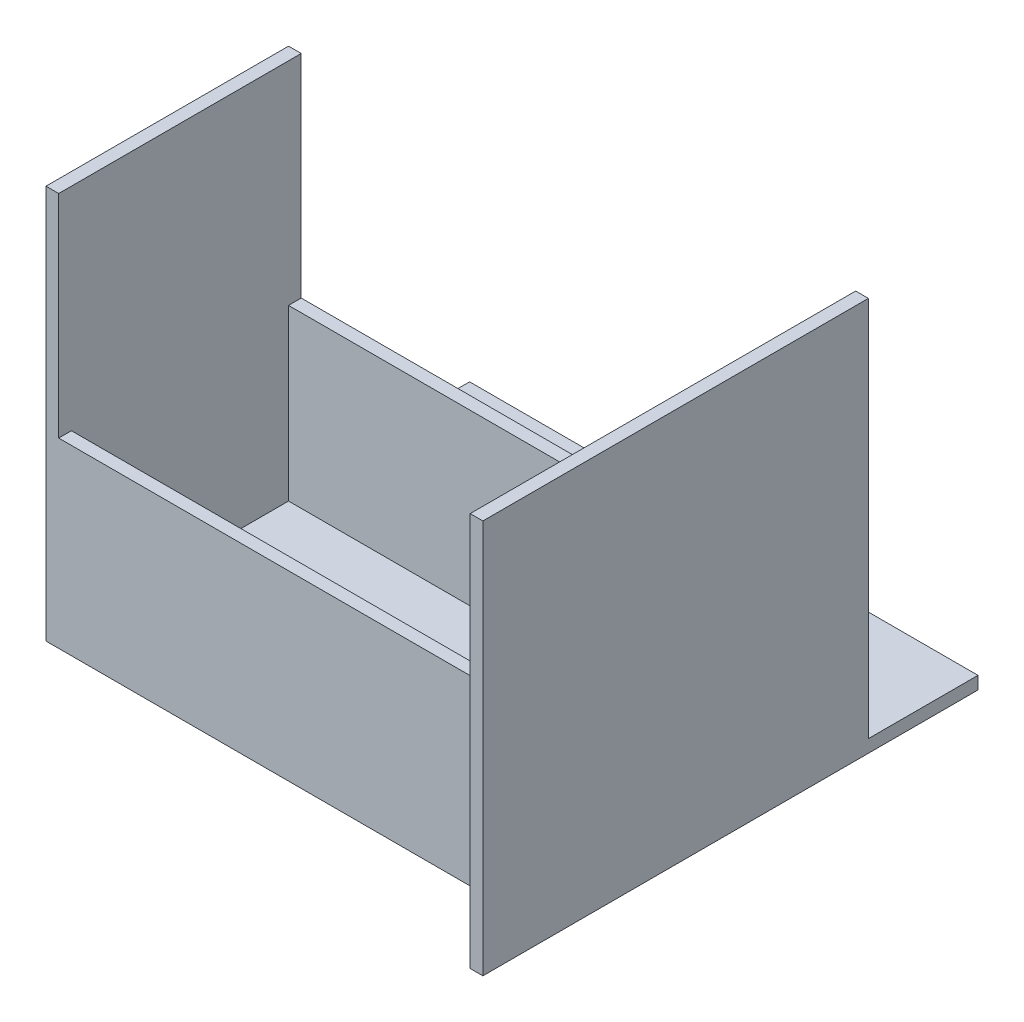
ISO-10303-21;
HEADER;
FILE_DESCRIPTION(('STEP AP214'),'2;1');
FILE_NAME('part.step','',(''),(''),'','','');
FILE_SCHEMA(('AUTOMOTIVE_DESIGN { 1 0 10303 214 1 1 1 1 }'));
ENDSEC;
DATA;
#1=APPLICATION_CONTEXT('core data for automotive mechanical design processes');
#2=APPLICATION_PROTOCOL_DEFINITION('international standard','automotive_design',2000,#1);
#3=PRODUCT_CONTEXT('',#1,'mechanical');
#4=PRODUCT('Part','Part','',(#3));
#5=PRODUCT_RELATED_PRODUCT_CATEGORY('part','',(#4));
#6=PRODUCT_DEFINITION_FORMATION('','',#4);
#7=PRODUCT_DEFINITION_CONTEXT('part definition',#1,'design');
#8=PRODUCT_DEFINITION('design','',#6,#7);
#9=PRODUCT_DEFINITION_SHAPE('','',#8);
#10=(LENGTH_UNIT() NAMED_UNIT(*) SI_UNIT(.MILLI.,.METRE.));
#11=(NAMED_UNIT(*) PLANE_ANGLE_UNIT() SI_UNIT($,.RADIAN.));
#12=(NAMED_UNIT(*) SI_UNIT($,.STERADIAN.) SOLID_ANGLE_UNIT());
#13=UNCERTAINTY_MEASURE_WITH_UNIT(LENGTH_MEASURE(1.E-05),#10,'distance_accuracy_value','');
#14=(GEOMETRIC_REPRESENTATION_CONTEXT(3) GLOBAL_UNCERTAINTY_ASSIGNED_CONTEXT((#13)) GLOBAL_UNIT_ASSIGNED_CONTEXT((#10,
#11,#12)) REPRESENTATION_CONTEXT('',''));
#15=CARTESIAN_POINT('',(0.,0.,0.));
#16=DIRECTION('',(0.,0.,1.));
#17=DIRECTION('',(1.,0.,0.));
#18=AXIS2_PLACEMENT_3D('',#15,#16,#17);
#19=CARTESIAN_POINT('',(0.,43.,0.));
#20=DIRECTION('',(0.,1.,0.));
#21=DIRECTION('',(0.,0.,1.));
#22=AXIS2_PLACEMENT_3D('',#19,#20,#21);
#23=PLANE('',#22);
#24=DIRECTION('',(0.,0.,1.));
#25=VECTOR('',#24,1.);
#26=CARTESIAN_POINT('',(117.,43.,0.));
#27=LINE('',#26,#25);
#28=CARTESIAN_POINT('',(117.,43.,-57.25));
#29=VERTEX_POINT('',#28);
#30=CARTESIAN_POINT('',(117.,43.,-54.25));
#31=VERTEX_POINT('',#30);
#32=EDGE_CURVE('E190',#29,#31,#27,.T.);
#33=ORIENTED_EDGE('',*,*,#32,.F.);
#34=DIRECTION('',(1.,0.,0.));
#35=VECTOR('',#34,1.);
#36=CARTESIAN_POINT('',(0.,43.,-57.25));
#37=LINE('',#36,#35);
#38=CARTESIAN_POINT('',(3.,43.,-57.25));
#39=VERTEX_POINT('',#38);
#40=EDGE_CURVE('E218',#39,#29,#37,.T.);
#41=ORIENTED_EDGE('',*,*,#40,.F.);
#42=DIRECTION('',(0.,0.,-1.));
#43=VECTOR('',#42,1.);
#44=CARTESIAN_POINT('',(3.,43.,-57.25));
#45=LINE('',#44,#43);
#46=CARTESIAN_POINT('',(3.,43.,-54.25));
#47=VERTEX_POINT('',#46);
#48=EDGE_CURVE('E11',#47,#39,#45,.T.);
#49=ORIENTED_EDGE('',*,*,#48,.F.);
#50=DIRECTION('',(-1.,0.,0.));
#51=VECTOR('',#50,1.);
#52=CARTESIAN_POINT('',(0.,43.,-54.25));
#53=LINE('',#52,#51);
#54=EDGE_CURVE('E222',#31,#47,#53,.T.);
#55=ORIENTED_EDGE('',*,*,#54,.F.);
#56=EDGE_LOOP('',(#33,#41,#49,#55));
#57=FACE_BOUND('',#56,.T.);
#58=ADVANCED_FACE('F35',(#57),#23,.T.);
#59=CARTESIAN_POINT('',(0.,3.,0.));
#60=DIRECTION('',(0.,-1.,0.));
#61=DIRECTION('',(0.,0.,-1.));
#62=AXIS2_PLACEMENT_3D('',#59,#60,#61);
#63=PLANE('',#62);
#64=DIRECTION('',(1.,0.,0.));
#65=VECTOR('',#64,1.);
#66=CARTESIAN_POINT('',(0.,3.,-57.25));
#67=LINE('',#66,#65);
#68=CARTESIAN_POINT('',(0.,3.,-57.25));
#69=VERTEX_POINT('',#68);
#70=CARTESIAN_POINT('',(117.,3.,-57.25));
#71=VERTEX_POINT('',#70);
#72=EDGE_CURVE('E214',#69,#71,#67,.T.);
#73=ORIENTED_EDGE('',*,*,#72,.T.);
#74=DIRECTION('',(0.,0.,-1.));
#75=VECTOR('',#74,1.);
#76=CARTESIAN_POINT('',(117.,3.,0.));
#77=LINE('',#76,#75);
#78=CARTESIAN_POINT('',(117.,3.,-74.125));
#79=VERTEX_POINT('',#78);
#80=EDGE_CURVE('E52',#71,#79,#77,.T.);
#81=ORIENTED_EDGE('',*,*,#80,.T.);
#82=DIRECTION('',(-1.,0.,0.));
#83=VECTOR('',#82,1.);
#84=CARTESIAN_POINT('',(0.,3.,-74.125));
#85=LINE('',#84,#83);
#86=CARTESIAN_POINT('',(120.,3.,-74.125));
#87=VERTEX_POINT('',#86);
#88=EDGE_CURVE('E56',#87,#79,#85,.T.);
#89=ORIENTED_EDGE('',*,*,#88,.F.);
#90=DIRECTION('',(0.,0.,-1.));
#91=VECTOR('',#90,1.);
#92=CARTESIAN_POINT('',(120.,3.,0.));
#93=LINE('',#92,#91);
#94=CARTESIAN_POINT('',(120.,3.,-100.));
#95=VERTEX_POINT('',#94);
#96=EDGE_CURVE('E254',#87,#95,#93,.T.);
#97=ORIENTED_EDGE('',*,*,#96,.T.);
#98=DIRECTION('',(-1.,0.,0.));
#99=VECTOR('',#98,1.);
#100=CARTESIAN_POINT('',(0.,3.,-100.));
#101=LINE('',#100,#99);
#102=CARTESIAN_POINT('',(0.,3.,-100.));
#103=VERTEX_POINT('',#102);
#104=EDGE_CURVE('E257',#95,#103,#101,.T.);
#105=ORIENTED_EDGE('',*,*,#104,.T.);
#106=DIRECTION('',(0.,0.,1.));
#107=VECTOR('',#106,1.);
#108=CARTESIAN_POINT('',(0.,3.,0.));
#109=LINE('',#108,#107);
#110=EDGE_CURVE('E251',#103,#69,#109,.T.);
#111=ORIENTED_EDGE('',*,*,#110,.T.);
#112=EDGE_LOOP('',(#73,#81,#89,#97,#105,#111));
#113=FACE_BOUND('',#112,.T.);
#114=ADVANCED_FACE('F306',(#113),#63,.F.);
#115=CARTESIAN_POINT('',(0.,3.,0.));
#116=DIRECTION('',(1.,0.,0.));
#117=DIRECTION('',(0.,0.,-1.));
#118=AXIS2_PLACEMENT_3D('',#115,#116,#117);
#119=PLANE('',#118);
#120=DIRECTION('',(0.,0.,1.));
#121=VECTOR('',#120,1.);
#122=CARTESIAN_POINT('',(0.,0.,0.));
#123=LINE('',#122,#121);
#124=CARTESIAN_POINT('',(0.,0.,-100.));
#125=VERTEX_POINT('',#124);
#126=CARTESIAN_POINT('',(0.,0.,0.));
#127=VERTEX_POINT('',#126);
#128=EDGE_CURVE('E249',#125,#127,#123,.T.);
#129=ORIENTED_EDGE('',*,*,#128,.T.);
#130=DIRECTION('',(0.,-1.,0.));
#131=VECTOR('',#130,1.);
#132=CARTESIAN_POINT('',(0.,3.,0.));
#133=LINE('',#132,#131);
#134=CARTESIAN_POINT('',(0.,93.,0.));
#135=VERTEX_POINT('',#134);
#136=EDGE_CURVE('E39',#135,#127,#133,.T.);
#137=ORIENTED_EDGE('',*,*,#136,.F.);
#138=DIRECTION('',(0.,0.,1.));
#139=VECTOR('',#138,1.);
#140=CARTESIAN_POINT('',(0.,93.,-57.25));
#141=LINE('',#140,#139);
#142=CARTESIAN_POINT('',(0.,93.,-57.25));
#143=VERTEX_POINT('',#142);
#144=EDGE_CURVE('E197',#143,#135,#141,.T.);
#145=ORIENTED_EDGE('',*,*,#144,.F.);
#146=DIRECTION('',(0.,-1.,0.));
#147=VECTOR('',#146,1.);
#148=CARTESIAN_POINT('',(0.,43.,-57.25));
#149=LINE('',#148,#147);
#150=EDGE_CURVE('E228',#143,#69,#149,.T.);
#151=ORIENTED_EDGE('',*,*,#150,.T.);
#152=ORIENTED_EDGE('',*,*,#110,.F.);
#153=DIRECTION('',(0.,-1.,0.));
#154=VECTOR('',#153,1.);
#155=CARTESIAN_POINT('',(0.,3.,-100.));
#156=LINE('',#155,#154);
#157=EDGE_CURVE('E259',#103,#125,#156,.T.);
#158=ORIENTED_EDGE('',*,*,#157,.T.);
#159=EDGE_LOOP('',(#129,#137,#145,#151,#152,#158));
#160=FACE_BOUND('',#159,.T.);
#161=ADVANCED_FACE('F37',(#160),#119,.F.);
#162=CARTESIAN_POINT('',(0.,3.,0.));
#163=DIRECTION('',(0.,0.,-1.));
#164=DIRECTION('',(-1.,0.,0.));
#165=AXIS2_PLACEMENT_3D('',#162,#163,#164);
#166=PLANE('',#165);
#167=DIRECTION('',(1.,0.,0.));
#168=VECTOR('',#167,1.);
#169=CARTESIAN_POINT('',(0.,0.,0.));
#170=LINE('',#169,#168);
#171=CARTESIAN_POINT('',(117.,0.,0.));
#172=VERTEX_POINT('',#171);
#173=EDGE_CURVE('E262',#127,#172,#170,.T.);
#174=ORIENTED_EDGE('',*,*,#173,.T.);
#175=DIRECTION('',(0.,1.,0.));
#176=VECTOR('',#175,1.);
#177=CARTESIAN_POINT('',(117.,3.,0.));
#178=LINE('',#177,#176);
#179=CARTESIAN_POINT('',(117.,43.,0.));
#180=VERTEX_POINT('',#179);
#181=EDGE_CURVE('E189',#172,#180,#178,.T.);
#182=ORIENTED_EDGE('',*,*,#181,.T.);
#183=DIRECTION('',(1.,0.,0.));
#184=VECTOR('',#183,1.);
#185=CARTESIAN_POINT('',(0.,43.,0.));
#186=LINE('',#185,#184);
#187=CARTESIAN_POINT('',(3.,43.,0.));
#188=VERTEX_POINT('',#187);
#189=EDGE_CURVE('E215',#188,#180,#186,.T.);
#190=ORIENTED_EDGE('',*,*,#189,.F.);
#191=DIRECTION('',(0.,-1.,0.));
#192=VECTOR('',#191,1.);
#193=CARTESIAN_POINT('',(3.00000000000001,93.,0.));
#194=LINE('',#193,#192);
#195=CARTESIAN_POINT('',(3.00000000000001,93.,0.));
#196=VERTEX_POINT('',#195);
#197=EDGE_CURVE('E211',#196,#188,#194,.T.);
#198=ORIENTED_EDGE('',*,*,#197,.F.);
#199=DIRECTION('',(1.,0.,0.));
#200=VECTOR('',#199,1.);
#201=CARTESIAN_POINT('',(0.,93.,0.));
#202=LINE('',#201,#200);
#203=EDGE_CURVE('E200',#135,#196,#202,.T.);
#204=ORIENTED_EDGE('',*,*,#203,.F.);
#205=ORIENTED_EDGE('',*,*,#136,.T.);
#206=EDGE_LOOP('',(#174,#182,#190,#198,#204,#205));
#207=FACE_BOUND('',#206,.T.);
#208=ADVANCED_FACE('F277',(#207),#166,.F.);
#209=CARTESIAN_POINT('',(120.,3.,0.));
#210=DIRECTION('',(-1.,0.,0.));
#211=DIRECTION('',(0.,0.,1.));
#212=AXIS2_PLACEMENT_3D('',#209,#210,#211);
#213=PLANE('',#212);
#214=ORIENTED_EDGE('',*,*,#96,.F.);
#215=DIRECTION('',(0.,-1.,0.));
#216=VECTOR('',#215,1.);
#217=CARTESIAN_POINT('',(120.,184.04943712072,-74.125));
#218=LINE('',#217,#216);
#219=CARTESIAN_POINT('',(120.,93.,-74.125));
#220=VERTEX_POINT('',#219);
#221=EDGE_CURVE('E165',#220,#87,#218,.T.);
#222=ORIENTED_EDGE('',*,*,#221,.F.);
#223=DIRECTION('',(0.,0.,-1.));
#224=VECTOR('',#223,1.);
#225=CARTESIAN_POINT('',(120.,93.,0.));
#226=LINE('',#225,#224);
#227=CARTESIAN_POINT('',(120.,93.,16.875));
#228=VERTEX_POINT('',#227);
#229=EDGE_CURVE('E155',#228,#220,#226,.T.);
#230=ORIENTED_EDGE('',*,*,#229,.F.);
#231=DIRECTION('',(0.,-1.,0.));
#232=VECTOR('',#231,1.);
#233=CARTESIAN_POINT('',(120.,184.04943712072,16.875));
#234=LINE('',#233,#232);
#235=CARTESIAN_POINT('',(120.,0.,16.875));
#236=VERTEX_POINT('',#235);
#237=EDGE_CURVE('E180',#228,#236,#234,.T.);
#238=ORIENTED_EDGE('',*,*,#237,.T.);
#239=DIRECTION('',(0.,0.,-1.));
#240=VECTOR('',#239,1.);
#241=CARTESIAN_POINT('',(120.,0.,0.));
#242=LINE('',#241,#240);
#243=CARTESIAN_POINT('',(120.,0.,-100.));
#244=VERTEX_POINT('',#243);
#245=EDGE_CURVE('E264',#236,#244,#242,.T.);
#246=ORIENTED_EDGE('',*,*,#245,.T.);
#247=DIRECTION('',(0.,-1.,0.));
#248=VECTOR('',#247,1.);
#249=CARTESIAN_POINT('',(120.,3.,-100.));
#250=LINE('',#249,#248);
#251=EDGE_CURVE('E268',#95,#244,#250,.T.);
#252=ORIENTED_EDGE('',*,*,#251,.F.);
#253=EDGE_LOOP('',(#214,#222,#230,#238,#246,#252));
#254=FACE_BOUND('',#253,.T.);
#255=ADVANCED_FACE('F309',(#254),#213,.F.);
#256=CARTESIAN_POINT('',(0.,3.,-100.));
#257=DIRECTION('',(0.,0.,1.));
#258=DIRECTION('',(1.,0.,0.));
#259=AXIS2_PLACEMENT_3D('',#256,#257,#258);
#260=PLANE('',#259);
#261=DIRECTION('',(-1.,0.,0.));
#262=VECTOR('',#261,1.);
#263=CARTESIAN_POINT('',(0.,0.,-100.));
#264=LINE('',#263,#262);
#265=EDGE_CURVE('E255',#244,#125,#264,.T.);
#266=ORIENTED_EDGE('',*,*,#265,.T.);
#267=ORIENTED_EDGE('',*,*,#157,.F.);
#268=ORIENTED_EDGE('',*,*,#104,.F.);
#269=ORIENTED_EDGE('',*,*,#251,.T.);
#270=EDGE_LOOP('',(#266,#267,#268,#269));
#271=FACE_BOUND('',#270,.T.);
#272=ADVANCED_FACE('F307',(#271),#260,.F.);
#273=CARTESIAN_POINT('',(0.,0.,0.));
#274=DIRECTION('',(0.,-1.,0.));
#275=DIRECTION('',(0.,0.,-1.));
#276=AXIS2_PLACEMENT_3D('',#273,#274,#275);
#277=PLANE('',#276);
#278=ORIENTED_EDGE('',*,*,#245,.F.);
#279=DIRECTION('',(-1.,0.,0.));
#280=VECTOR('',#279,1.);
#281=CARTESIAN_POINT('',(0.,0.,16.8750000000001));
#282=LINE('',#281,#280);
#283=CARTESIAN_POINT('',(117.,0.,16.875));
#284=VERTEX_POINT('',#283);
#285=EDGE_CURVE('E159',#236,#284,#282,.T.);
#286=ORIENTED_EDGE('',*,*,#285,.T.);
#287=DIRECTION('',(0.,0.,-1.));
#288=VECTOR('',#287,1.);
#289=CARTESIAN_POINT('',(117.,0.,0.));
#290=LINE('',#289,#288);
#291=EDGE_CURVE('E172',#284,#172,#290,.T.);
#292=ORIENTED_EDGE('',*,*,#291,.T.);
#293=ORIENTED_EDGE('',*,*,#173,.F.);
#294=ORIENTED_EDGE('',*,*,#128,.F.);
#295=ORIENTED_EDGE('',*,*,#265,.F.);
#296=EDGE_LOOP('',(#278,#286,#292,#293,#294,#295));
#297=FACE_BOUND('',#296,.T.);
#298=ADVANCED_FACE('F286',(#297),#277,.T.);
#299=CARTESIAN_POINT('',(0.,43.,-54.25));
#300=DIRECTION('',(0.,0.,1.));
#301=DIRECTION('',(1.,0.,0.));
#302=AXIS2_PLACEMENT_3D('',#299,#300,#301);
#303=PLANE('',#302);
#304=DIRECTION('',(-1.,0.,0.));
#305=VECTOR('',#304,1.);
#306=CARTESIAN_POINT('',(0.,3.,-54.25));
#307=LINE('',#306,#305);
#308=CARTESIAN_POINT('',(117.,3.,-54.25));
#309=VERTEX_POINT('',#308);
#310=CARTESIAN_POINT('',(3.,3.,-54.25));
#311=VERTEX_POINT('',#310);
#312=EDGE_CURVE('E230',#309,#311,#307,.T.);
#313=ORIENTED_EDGE('',*,*,#312,.F.);
#314=DIRECTION('',(0.,-1.,0.));
#315=VECTOR('',#314,1.);
#316=CARTESIAN_POINT('',(117.,43.,-54.25));
#317=LINE('',#316,#315);
#318=EDGE_CURVE('E246',#31,#309,#317,.T.);
#319=ORIENTED_EDGE('',*,*,#318,.F.);
#320=ORIENTED_EDGE('',*,*,#54,.T.);
#321=DIRECTION('',(0.,-1.,0.));
#322=VECTOR('',#321,1.);
#323=CARTESIAN_POINT('',(3.,43.,-54.25));
#324=LINE('',#323,#322);
#325=EDGE_CURVE('E237',#47,#311,#324,.T.);
#326=ORIENTED_EDGE('',*,*,#325,.T.);
#327=EDGE_LOOP('',(#313,#319,#320,#326));
#328=FACE_BOUND('',#327,.T.);
#329=ADVANCED_FACE('F316',(#328),#303,.T.);
#330=CARTESIAN_POINT('',(117.,43.,0.));
#331=DIRECTION('',(1.,0.,0.));
#332=DIRECTION('',(0.,0.,-1.));
#333=AXIS2_PLACEMENT_3D('',#330,#331,#332);
#334=PLANE('',#333);
#335=DIRECTION('',(0.,0.,1.));
#336=VECTOR('',#335,1.);
#337=CARTESIAN_POINT('',(117.,3.,0.));
#338=LINE('',#337,#336);
#339=CARTESIAN_POINT('',(117.,3.,-3.));
#340=VERTEX_POINT('',#339);
#341=EDGE_CURVE('E232',#309,#340,#338,.T.);
#342=ORIENTED_EDGE('',*,*,#341,.T.);
#343=DIRECTION('',(0.,-1.,0.));
#344=VECTOR('',#343,1.);
#345=CARTESIAN_POINT('',(117.,43.,-3.));
#346=LINE('',#345,#344);
#347=CARTESIAN_POINT('',(117.,43.,-3.));
#348=VERTEX_POINT('',#347);
#349=EDGE_CURVE('E243',#348,#340,#346,.T.);
#350=ORIENTED_EDGE('',*,*,#349,.F.);
#351=EDGE_CURVE('E186',#348,#180,#27,.T.);
#352=ORIENTED_EDGE('',*,*,#351,.T.);
#353=ORIENTED_EDGE('',*,*,#181,.F.);
#354=ORIENTED_EDGE('',*,*,#291,.F.);
#355=DIRECTION('',(0.,-1.,0.));
#356=VECTOR('',#355,1.);
#357=CARTESIAN_POINT('',(117.,184.04943712072,16.875));
#358=LINE('',#357,#356);
#359=CARTESIAN_POINT('',(117.,93.,16.875));
#360=VERTEX_POINT('',#359);
#361=EDGE_CURVE('E171',#360,#284,#358,.T.);
#362=ORIENTED_EDGE('',*,*,#361,.F.);
#363=DIRECTION('',(0.,0.,-1.));
#364=VECTOR('',#363,1.);
#365=CARTESIAN_POINT('',(117.,93.,0.));
#366=LINE('',#365,#364);
#367=CARTESIAN_POINT('',(117.,93.,-74.125));
#368=VERTEX_POINT('',#367);
#369=EDGE_CURVE('E152',#360,#368,#366,.T.);
#370=ORIENTED_EDGE('',*,*,#369,.T.);
#371=DIRECTION('',(0.,-1.,0.));
#372=VECTOR('',#371,1.);
#373=CARTESIAN_POINT('',(117.,184.04943712072,-74.125));
#374=LINE('',#373,#372);
#375=EDGE_CURVE('E162',#368,#79,#374,.T.);
#376=ORIENTED_EDGE('',*,*,#375,.T.);
#377=ORIENTED_EDGE('',*,*,#80,.F.);
#378=DIRECTION('',(0.,1.,0.));
#379=VECTOR('',#378,1.);
#380=CARTESIAN_POINT('',(117.,43.,-57.25));
#381=LINE('',#380,#379);
#382=EDGE_CURVE('E192',#71,#29,#381,.T.);
#383=ORIENTED_EDGE('',*,*,#382,.T.);
#384=ORIENTED_EDGE('',*,*,#32,.T.);
#385=ORIENTED_EDGE('',*,*,#318,.T.);
#386=EDGE_LOOP('',(#342,#350,#352,#353,#354,#362,#370,#376,#377,#383,#384,#385));
#387=FACE_BOUND('',#386,.T.);
#388=ADVANCED_FACE('F169',(#387),#334,.F.);
#389=CARTESIAN_POINT('',(0.,43.,-3.));
#390=DIRECTION('',(0.,0.,-1.));
#391=DIRECTION('',(-1.,0.,0.));
#392=AXIS2_PLACEMENT_3D('',#389,#390,#391);
#393=PLANE('',#392);
#394=DIRECTION('',(1.,0.,0.));
#395=VECTOR('',#394,1.);
#396=CARTESIAN_POINT('',(0.,3.,-3.));
#397=LINE('',#396,#395);
#398=CARTESIAN_POINT('',(3.00000000000001,3.,-3.));
#399=VERTEX_POINT('',#398);
#400=EDGE_CURVE('E234',#399,#340,#397,.T.);
#401=ORIENTED_EDGE('',*,*,#400,.F.);
#402=DIRECTION('',(0.,-1.,0.));
#403=VECTOR('',#402,1.);
#404=CARTESIAN_POINT('',(3.00000000000001,43.,-3.));
#405=LINE('',#404,#403);
#406=CARTESIAN_POINT('',(3.00000000000001,43.,-3.));
#407=VERTEX_POINT('',#406);
#408=EDGE_CURVE('E240',#407,#399,#405,.T.);
#409=ORIENTED_EDGE('',*,*,#408,.F.);
#410=DIRECTION('',(1.,0.,0.));
#411=VECTOR('',#410,1.);
#412=CARTESIAN_POINT('',(0.,43.,-3.));
#413=LINE('',#412,#411);
#414=EDGE_CURVE('E225',#407,#348,#413,.T.);
#415=ORIENTED_EDGE('',*,*,#414,.T.);
#416=ORIENTED_EDGE('',*,*,#349,.T.);
#417=EDGE_LOOP('',(#401,#409,#415,#416));
#418=FACE_BOUND('',#417,.T.);
#419=ADVANCED_FACE('F344',(#418),#393,.T.);
#420=CARTESIAN_POINT('',(0.,43.,-57.25));
#421=DIRECTION('',(0.,0.,-1.));
#422=DIRECTION('',(-1.,0.,0.));
#423=AXIS2_PLACEMENT_3D('',#420,#421,#422);
#424=PLANE('',#423);
#425=ORIENTED_EDGE('',*,*,#382,.F.);
#426=ORIENTED_EDGE('',*,*,#72,.F.);
#427=ORIENTED_EDGE('',*,*,#150,.F.);
#428=DIRECTION('',(-1.,0.,0.));
#429=VECTOR('',#428,1.);
#430=CARTESIAN_POINT('',(0.,93.,-57.25));
#431=LINE('',#430,#429);
#432=CARTESIAN_POINT('',(3.,93.,-57.25));
#433=VERTEX_POINT('',#432);
#434=EDGE_CURVE('E204',#433,#143,#431,.T.);
#435=ORIENTED_EDGE('',*,*,#434,.F.);
#436=DIRECTION('',(0.,-1.,0.));
#437=VECTOR('',#436,1.);
#438=CARTESIAN_POINT('',(3.,93.,-57.25));
#439=LINE('',#438,#437);
#440=EDGE_CURVE('E206',#433,#39,#439,.T.);
#441=ORIENTED_EDGE('',*,*,#440,.T.);
#442=ORIENTED_EDGE('',*,*,#40,.T.);
#443=EDGE_LOOP('',(#425,#426,#427,#435,#441,#442));
#444=FACE_BOUND('',#443,.T.);
#445=ADVANCED_FACE('F305',(#444),#424,.T.);
#446=CARTESIAN_POINT('',(3.00000000000001,43.,0.));
#447=DIRECTION('',(1.,0.,0.));
#448=DIRECTION('',(0.,0.,-1.));
#449=AXIS2_PLACEMENT_3D('',#446,#447,#448);
#450=PLANE('',#449);
#451=DIRECTION('',(0.,0.,1.));
#452=VECTOR('',#451,1.);
#453=CARTESIAN_POINT('',(3.00000000000001,3.,0.));
#454=LINE('',#453,#452);
#455=EDGE_CURVE('E219',#311,#399,#454,.T.);
#456=ORIENTED_EDGE('',*,*,#455,.F.);
#457=ORIENTED_EDGE('',*,*,#325,.F.);
#458=ORIENTED_EDGE('',*,*,#48,.T.);
#459=ORIENTED_EDGE('',*,*,#440,.F.);
#460=DIRECTION('',(0.,0.,-1.));
#461=VECTOR('',#460,1.);
#462=CARTESIAN_POINT('',(3.,93.,-57.25));
#463=LINE('',#462,#461);
#464=EDGE_CURVE('E202',#196,#433,#463,.T.);
#465=ORIENTED_EDGE('',*,*,#464,.F.);
#466=ORIENTED_EDGE('',*,*,#197,.T.);
#467=EDGE_CURVE('E45',#188,#407,#45,.T.);
#468=ORIENTED_EDGE('',*,*,#467,.T.);
#469=ORIENTED_EDGE('',*,*,#408,.T.);
#470=EDGE_LOOP('',(#456,#457,#458,#459,#465,#466,#468,#469));
#471=FACE_BOUND('',#470,.T.);
#472=ADVANCED_FACE('F296',(#471),#450,.T.);
#473=ORIENTED_EDGE('',*,*,#351,.F.);
#474=ORIENTED_EDGE('',*,*,#414,.F.);
#475=ORIENTED_EDGE('',*,*,#467,.F.);
#476=ORIENTED_EDGE('',*,*,#189,.T.);
#477=EDGE_LOOP('',(#473,#474,#475,#476));
#478=FACE_BOUND('',#477,.T.);
#479=ADVANCED_FACE('F292',(#478),#23,.T.);
#480=ORIENTED_EDGE('',*,*,#341,.F.);
#481=ORIENTED_EDGE('',*,*,#312,.T.);
#482=ORIENTED_EDGE('',*,*,#455,.T.);
#483=ORIENTED_EDGE('',*,*,#400,.T.);
#484=EDGE_LOOP('',(#480,#481,#482,#483));
#485=FACE_BOUND('',#484,.T.);
#486=ADVANCED_FACE('F329',(#485),#63,.F.);
#487=CARTESIAN_POINT('',(0.,93.,0.));
#488=DIRECTION('',(0.,1.,0.));
#489=DIRECTION('',(0.,0.,1.));
#490=AXIS2_PLACEMENT_3D('',#487,#488,#489);
#491=PLANE('',#490);
#492=ORIENTED_EDGE('',*,*,#144,.T.);
#493=ORIENTED_EDGE('',*,*,#203,.T.);
#494=ORIENTED_EDGE('',*,*,#464,.T.);
#495=ORIENTED_EDGE('',*,*,#434,.T.);
#496=EDGE_LOOP('',(#492,#493,#494,#495));
#497=FACE_BOUND('',#496,.T.);
#498=ADVANCED_FACE('F302',(#497),#491,.T.);
#499=CARTESIAN_POINT('',(0.,184.04943712072,-74.125));
#500=DIRECTION('',(0.,0.,1.));
#501=DIRECTION('',(1.,0.,0.));
#502=AXIS2_PLACEMENT_3D('',#499,#500,#501);
#503=PLANE('',#502);
#504=ORIENTED_EDGE('',*,*,#221,.T.);
#505=ORIENTED_EDGE('',*,*,#88,.T.);
#506=ORIENTED_EDGE('',*,*,#375,.F.);
#507=DIRECTION('',(-1.,0.,0.));
#508=VECTOR('',#507,1.);
#509=CARTESIAN_POINT('',(0.,93.,-74.125));
#510=LINE('',#509,#508);
#511=EDGE_CURVE('E148',#220,#368,#510,.T.);
#512=ORIENTED_EDGE('',*,*,#511,.F.);
#513=EDGE_LOOP('',(#504,#505,#506,#512));
#514=FACE_BOUND('',#513,.T.);
#515=ADVANCED_FACE('F163',(#514),#503,.F.);
#516=CARTESIAN_POINT('',(0.,93.,0.));
#517=DIRECTION('',(0.,1.,0.));
#518=DIRECTION('',(0.,0.,1.));
#519=AXIS2_PLACEMENT_3D('',#516,#517,#518);
#520=PLANE('',#519);
#521=DIRECTION('',(-1.,0.,0.));
#522=VECTOR('',#521,1.);
#523=CARTESIAN_POINT('',(0.,93.,16.8750000000001));
#524=LINE('',#523,#522);
#525=EDGE_CURVE('E178',#228,#360,#524,.T.);
#526=ORIENTED_EDGE('',*,*,#525,.F.);
#527=ORIENTED_EDGE('',*,*,#229,.T.);
#528=ORIENTED_EDGE('',*,*,#511,.T.);
#529=ORIENTED_EDGE('',*,*,#369,.F.);
#530=EDGE_LOOP('',(#526,#527,#528,#529));
#531=FACE_BOUND('',#530,.T.);
#532=ADVANCED_FACE('F150',(#531),#520,.T.);
#533=CARTESIAN_POINT('',(0.,184.04943712072,16.8750000000001));
#534=DIRECTION('',(0.,0.,1.));
#535=DIRECTION('',(1.,0.,0.));
#536=AXIS2_PLACEMENT_3D('',#533,#534,#535);
#537=PLANE('',#536);
#538=ORIENTED_EDGE('',*,*,#237,.F.);
#539=ORIENTED_EDGE('',*,*,#525,.T.);
#540=ORIENTED_EDGE('',*,*,#361,.T.);
#541=ORIENTED_EDGE('',*,*,#285,.F.);
#542=EDGE_LOOP('',(#538,#539,#540,#541));
#543=FACE_BOUND('',#542,.T.);
#544=ADVANCED_FACE('F535',(#543),#537,.T.);
#545=CLOSED_SHELL('',(#58,#114,#161,#208,#255,#272,#298,#329,#388,#419,#445,#472,#479,#486,#498,
#515,#532,#544));
#546=MANIFOLD_SOLID_BREP('B2',#545);
#547=ADVANCED_BREP_SHAPE_REPRESENTATION('',(#18,#546),#14);
#548=SHAPE_DEFINITION_REPRESENTATION(#9,#547);
ENDSEC;
END-ISO-10303-21;
